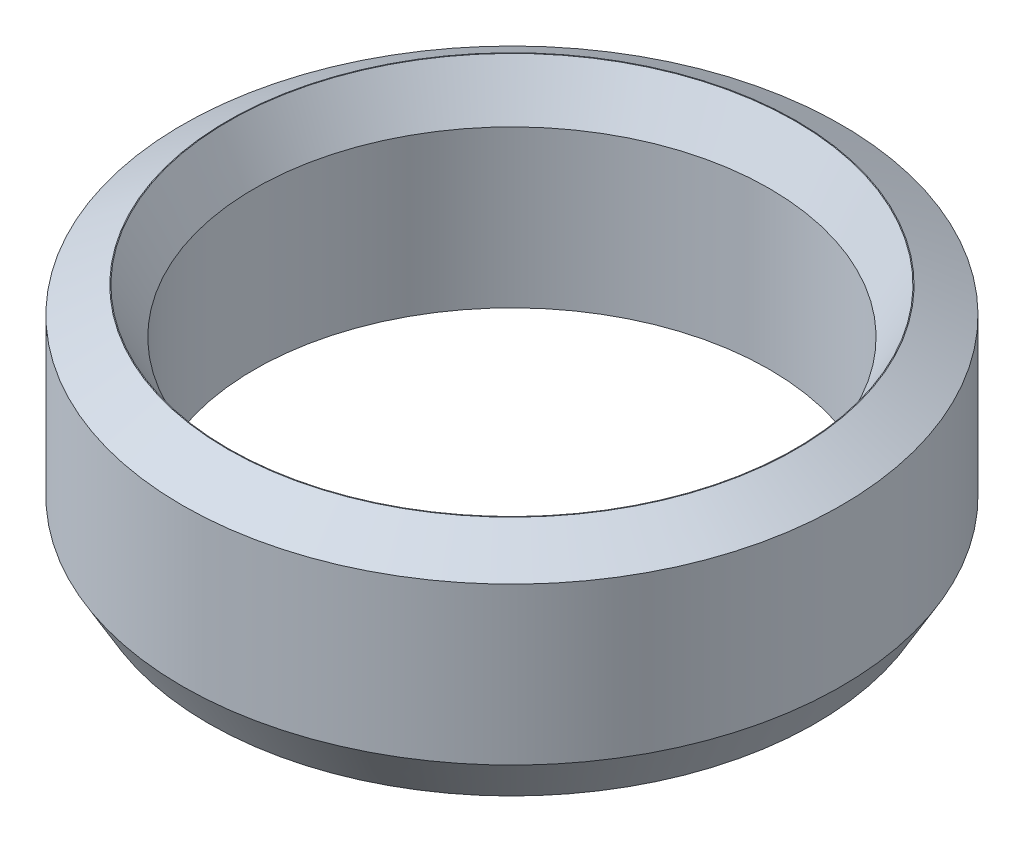
ISO-10303-21;
HEADER;
FILE_DESCRIPTION(('STEP AP214'),'2;1');
FILE_NAME('part.step','',(''),(''),'','','');
FILE_SCHEMA(('AUTOMOTIVE_DESIGN { 1 0 10303 214 1 1 1 1 }'));
ENDSEC;
DATA;
#1=APPLICATION_CONTEXT('core data for automotive mechanical design processes');
#2=APPLICATION_PROTOCOL_DEFINITION('international standard','automotive_design',2000,#1);
#3=PRODUCT_CONTEXT('',#1,'mechanical');
#4=PRODUCT('Part','Part','',(#3));
#5=PRODUCT_RELATED_PRODUCT_CATEGORY('part','',(#4));
#6=PRODUCT_DEFINITION_FORMATION('','',#4);
#7=PRODUCT_DEFINITION_CONTEXT('part definition',#1,'design');
#8=PRODUCT_DEFINITION('design','',#6,#7);
#9=PRODUCT_DEFINITION_SHAPE('','',#8);
#10=(LENGTH_UNIT() NAMED_UNIT(*) SI_UNIT(.MILLI.,.METRE.));
#11=(NAMED_UNIT(*) PLANE_ANGLE_UNIT() SI_UNIT($,.RADIAN.));
#12=(NAMED_UNIT(*) SI_UNIT($,.STERADIAN.) SOLID_ANGLE_UNIT());
#13=UNCERTAINTY_MEASURE_WITH_UNIT(LENGTH_MEASURE(1.E-05),#10,'distance_accuracy_value','');
#14=(GEOMETRIC_REPRESENTATION_CONTEXT(3) GLOBAL_UNCERTAINTY_ASSIGNED_CONTEXT((#13)) GLOBAL_UNIT_ASSIGNED_CONTEXT((#10,
#11,#12)) REPRESENTATION_CONTEXT('',''));
#15=CARTESIAN_POINT('',(0.,0.,0.));
#16=DIRECTION('',(0.,0.,1.));
#17=DIRECTION('',(1.,0.,0.));
#18=AXIS2_PLACEMENT_3D('',#15,#16,#17);
#19=CARTESIAN_POINT('',(0.,22.4825106825703,0.));
#20=DIRECTION('',(0.,-1.,0.));
#21=DIRECTION('',(0.,0.,-1.));
#22=AXIS2_PLACEMENT_3D('',#19,#20,#21);
#23=CYLINDRICAL_SURFACE('',#22,32.5);
#24=CARTESIAN_POINT('',(0.,4.45606951447478,0.));
#25=DIRECTION('',(0.,1.,0.));
#26=DIRECTION('',(0.,0.,1.));
#27=AXIS2_PLACEMENT_3D('',#24,#25,#26);
#28=CIRCLE('',#27,32.5);
#29=CARTESIAN_POINT('',(0.,4.45606951447478,32.5));
#30=VERTEX_POINT('',#29);
#31=EDGE_CURVE('E10',#30,#30,#28,.T.);
#32=ORIENTED_EDGE('',*,*,#31,.T.);
#33=EDGE_LOOP('',(#32));
#34=FACE_BOUND('',#33,.T.);
#35=CARTESIAN_POINT('',(0.,19.9097977488606,0.));
#36=DIRECTION('',(0.,1.,0.));
#37=DIRECTION('',(0.,0.,1.));
#38=AXIS2_PLACEMENT_3D('',#35,#36,#37);
#39=CIRCLE('',#38,32.5);
#40=CARTESIAN_POINT('',(0.,19.9097977488606,32.5));
#41=VERTEX_POINT('',#40);
#42=EDGE_CURVE('E50',#41,#41,#39,.F.);
#43=ORIENTED_EDGE('',*,*,#42,.T.);
#44=EDGE_LOOP('',(#43));
#45=FACE_BOUND('',#44,.T.);
#46=ADVANCED_FACE('F39',(#34,#45),#23,.T.);
#47=CARTESIAN_POINT('',(0.,22.4825106825703,0.));
#48=DIRECTION('',(0.,1.,0.));
#49=DIRECTION('',(0.,0.,1.));
#50=AXIS2_PLACEMENT_3D('',#47,#48,#49);
#51=PLANE('',#50);
#52=CARTESIAN_POINT('',(0.,22.4825106825703,0.));
#53=DIRECTION('',(0.,1.,0.));
#54=DIRECTION('',(0.,0.,1.));
#55=AXIS2_PLACEMENT_3D('',#52,#53,#54);
#56=CIRCLE('',#55,27.9666399980904);
#57=CARTESIAN_POINT('',(0.,22.4825106825703,27.9666399980904));
#58=VERTEX_POINT('',#57);
#59=EDGE_CURVE('E58',#58,#58,#56,.F.);
#60=ORIENTED_EDGE('',*,*,#59,.T.);
#61=EDGE_LOOP('',(#60));
#62=FACE_BOUND('',#61,.T.);
#63=CARTESIAN_POINT('',(0.,22.4825106825703,0.));
#64=DIRECTION('',(0.,1.,0.));
#65=DIRECTION('',(0.,0.,1.));
#66=AXIS2_PLACEMENT_3D('',#63,#64,#65);
#67=CIRCLE('',#66,28.0439304855252);
#68=CARTESIAN_POINT('',(0.,22.4825106825703,28.0439304855252));
#69=VERTEX_POINT('',#68);
#70=EDGE_CURVE('E61',#69,#69,#67,.T.);
#71=ORIENTED_EDGE('',*,*,#70,.T.);
#72=EDGE_LOOP('',(#71));
#73=FACE_BOUND('',#72,.T.);
#74=ADVANCED_FACE('F88',(#62,#73),#51,.T.);
#75=CARTESIAN_POINT('',(0.,0.,0.));
#76=DIRECTION('',(0.,1.,0.));
#77=DIRECTION('',(0.,0.,1.));
#78=AXIS2_PLACEMENT_3D('',#75,#76,#77);
#79=PLANE('',#78);
#80=CARTESIAN_POINT('',(0.,0.,0.));
#81=DIRECTION('',(0.,1.,0.));
#82=DIRECTION('',(0.,0.,1.));
#83=AXIS2_PLACEMENT_3D('',#80,#81,#82);
#84=CIRCLE('',#83,29.8499965788554);
#85=CARTESIAN_POINT('',(0.,0.,29.8499965788554));
#86=VERTEX_POINT('',#85);
#87=EDGE_CURVE('E51',#86,#86,#84,.T.);
#88=ORIENTED_EDGE('',*,*,#87,.T.);
#89=EDGE_LOOP('',(#88));
#90=FACE_BOUND('',#89,.T.);
#91=CARTESIAN_POINT('',(0.,0.,0.));
#92=DIRECTION('',(0.,1.,0.));
#93=DIRECTION('',(0.,0.,1.));
#94=AXIS2_PLACEMENT_3D('',#91,#92,#93);
#95=CIRCLE('',#94,29.9272870662903);
#96=CARTESIAN_POINT('',(0.,0.,29.9272870662903));
#97=VERTEX_POINT('',#96);
#98=EDGE_CURVE('E54',#97,#97,#95,.F.);
#99=ORIENTED_EDGE('',*,*,#98,.T.);
#100=EDGE_LOOP('',(#99));
#101=FACE_BOUND('',#100,.T.);
#102=ADVANCED_FACE('F83',(#90,#101),#79,.F.);
#103=CARTESIAN_POINT('',(0.,22.4825106825703,0.));
#104=DIRECTION('',(0.,-1.,0.));
#105=DIRECTION('',(0.,0.,-1.));
#106=AXIS2_PLACEMENT_3D('',#103,#104,#105);
#107=CYLINDRICAL_SURFACE('',#106,25.3939270643806);
#108=CARTESIAN_POINT('',(0.,18.0264411680955,0.));
#109=DIRECTION('',(0.,1.,0.));
#110=DIRECTION('',(0.,0.,1.));
#111=AXIS2_PLACEMENT_3D('',#108,#109,#110);
#112=CIRCLE('',#111,25.3939270643806);
#113=CARTESIAN_POINT('',(0.,18.0264411680955,25.3939270643806));
#114=VERTEX_POINT('',#113);
#115=EDGE_CURVE('E67',#114,#114,#112,.T.);
#116=ORIENTED_EDGE('',*,*,#115,.T.);
#117=EDGE_LOOP('',(#116));
#118=FACE_BOUND('',#117,.T.);
#119=CARTESIAN_POINT('',(0.,2.57271293370972,0.));
#120=DIRECTION('',(0.,1.,0.));
#121=DIRECTION('',(0.,0.,1.));
#122=AXIS2_PLACEMENT_3D('',#119,#120,#121);
#123=CIRCLE('',#122,25.3939270643806);
#124=CARTESIAN_POINT('',(0.,2.57271293370972,25.3939270643806));
#125=VERTEX_POINT('',#124);
#126=EDGE_CURVE('E69',#125,#125,#123,.F.);
#127=ORIENTED_EDGE('',*,*,#126,.T.);
#128=EDGE_LOOP('',(#127));
#129=FACE_BOUND('',#128,.T.);
#130=ADVANCED_FACE('F71',(#118,#129),#107,.F.);
#131=CARTESIAN_POINT('',(0.,18.0264411680955,0.));
#132=DIRECTION('',(0.,1.,0.));
#133=DIRECTION('',(0.,0.,1.));
#134=AXIS2_PLACEMENT_3D('',#131,#132,#133);
#135=CONICAL_SURFACE('',#134,25.3939270643806,0.523598775598302);
#136=ORIENTED_EDGE('',*,*,#59,.F.);
#137=EDGE_LOOP('',(#136));
#138=FACE_BOUND('',#137,.T.);
#139=ORIENTED_EDGE('',*,*,#115,.F.);
#140=EDGE_LOOP('',(#139));
#141=FACE_BOUND('',#140,.T.);
#142=ADVANCED_FACE('F77',(#138,#141),#135,.F.);
#143=CARTESIAN_POINT('',(0.,0.,0.));
#144=DIRECTION('',(0.,-1.,0.));
#145=DIRECTION('',(0.,0.,-1.));
#146=AXIS2_PLACEMENT_3D('',#143,#144,#145);
#147=CONICAL_SURFACE('',#146,29.8499965788554,1.04719755119659);
#148=ORIENTED_EDGE('',*,*,#126,.F.);
#149=EDGE_LOOP('',(#148));
#150=FACE_BOUND('',#149,.T.);
#151=ORIENTED_EDGE('',*,*,#87,.F.);
#152=EDGE_LOOP('',(#151));
#153=FACE_BOUND('',#152,.T.);
#154=ADVANCED_FACE('F73',(#150,#153),#147,.F.);
#155=CARTESIAN_POINT('',(0.,4.45606951447478,0.));
#156=DIRECTION('',(0.,1.,0.));
#157=DIRECTION('',(0.,0.,1.));
#158=AXIS2_PLACEMENT_3D('',#155,#156,#157);
#159=CONICAL_SURFACE('',#158,32.5,0.523598775598303);
#160=ORIENTED_EDGE('',*,*,#98,.F.);
#161=EDGE_LOOP('',(#160));
#162=FACE_BOUND('',#161,.T.);
#163=ORIENTED_EDGE('',*,*,#31,.F.);
#164=EDGE_LOOP('',(#163));
#165=FACE_BOUND('',#164,.T.);
#166=ADVANCED_FACE('F76',(#162,#165),#159,.T.);
#167=CARTESIAN_POINT('',(0.,22.4825106825703,0.));
#168=DIRECTION('',(0.,-1.,0.));
#169=DIRECTION('',(0.,0.,-1.));
#170=AXIS2_PLACEMENT_3D('',#167,#168,#169);
#171=CONICAL_SURFACE('',#170,28.0439304855252,1.04719755119659);
#172=ORIENTED_EDGE('',*,*,#42,.F.);
#173=EDGE_LOOP('',(#172));
#174=FACE_BOUND('',#173,.T.);
#175=ORIENTED_EDGE('',*,*,#70,.F.);
#176=EDGE_LOOP('',(#175));
#177=FACE_BOUND('',#176,.T.);
#178=ADVANCED_FACE('F45',(#174,#177),#171,.T.);
#179=CLOSED_SHELL('',(#46,#74,#102,#130,#142,#154,#166,#178));
#180=MANIFOLD_SOLID_BREP('B2',#179);
#181=ADVANCED_BREP_SHAPE_REPRESENTATION('',(#18,#180),#14);
#182=SHAPE_DEFINITION_REPRESENTATION(#9,#181);
ENDSEC;
END-ISO-10303-21;
